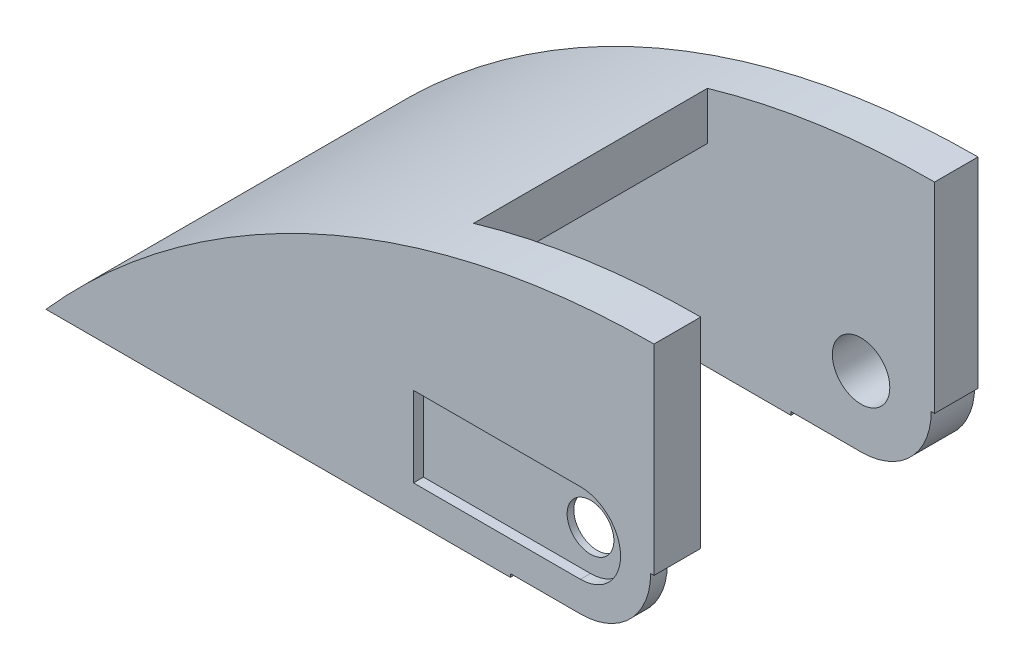
ISO-10303-21;
HEADER;
FILE_DESCRIPTION(('STEP AP214'),'2;1');
FILE_NAME('part.step','',(''),(''),'','','');
FILE_SCHEMA(('AUTOMOTIVE_DESIGN { 1 0 10303 214 1 1 1 1 }'));
ENDSEC;
DATA;
#1=APPLICATION_CONTEXT('core data for automotive mechanical design processes');
#2=APPLICATION_PROTOCOL_DEFINITION('international standard','automotive_design',2000,#1);
#3=PRODUCT_CONTEXT('',#1,'mechanical');
#4=PRODUCT('Part','Part','',(#3));
#5=PRODUCT_RELATED_PRODUCT_CATEGORY('part','',(#4));
#6=PRODUCT_DEFINITION_FORMATION('','',#4);
#7=PRODUCT_DEFINITION_CONTEXT('part definition',#1,'design');
#8=PRODUCT_DEFINITION('design','',#6,#7);
#9=PRODUCT_DEFINITION_SHAPE('','',#8);
#10=(LENGTH_UNIT() NAMED_UNIT(*) SI_UNIT(.MILLI.,.METRE.));
#11=(NAMED_UNIT(*) PLANE_ANGLE_UNIT() SI_UNIT($,.RADIAN.));
#12=(NAMED_UNIT(*) SI_UNIT($,.STERADIAN.) SOLID_ANGLE_UNIT());
#13=UNCERTAINTY_MEASURE_WITH_UNIT(LENGTH_MEASURE(1.E-05),#10,'distance_accuracy_value','');
#14=(GEOMETRIC_REPRESENTATION_CONTEXT(3) GLOBAL_UNCERTAINTY_ASSIGNED_CONTEXT((#13)) GLOBAL_UNIT_ASSIGNED_CONTEXT((#10,
#11,#12)) REPRESENTATION_CONTEXT('',''));
#15=CARTESIAN_POINT('',(0.,0.,0.));
#16=DIRECTION('',(0.,0.,1.));
#17=DIRECTION('',(1.,0.,0.));
#18=AXIS2_PLACEMENT_3D('',#15,#16,#17);
#19=CARTESIAN_POINT('',(0.,0.,0.));
#20=DIRECTION('',(0.,0.,1.));
#21=DIRECTION('',(1.,0.,0.));
#22=AXIS2_PLACEMENT_3D('',#19,#20,#21);
#23=PLANE('',#22);
#24=DIRECTION('',(-1.,0.,0.));
#25=VECTOR('',#24,1.);
#26=CARTESIAN_POINT('',(0.,0.,0.));
#27=LINE('',#26,#25);
#28=CARTESIAN_POINT('',(11.,0.,0.));
#29=VERTEX_POINT('',#28);
#30=CARTESIAN_POINT('',(10.5,0.,0.));
#31=VERTEX_POINT('',#30);
#32=EDGE_CURVE('E297',#29,#31,#27,.T.);
#33=ORIENTED_EDGE('',*,*,#32,.F.);
#34=DIRECTION('',(0.,-1.,0.));
#35=VECTOR('',#34,1.);
#36=CARTESIAN_POINT('',(11.,0.,0.));
#37=LINE('',#36,#35);
#38=CARTESIAN_POINT('',(11.,30.,0.));
#39=VERTEX_POINT('',#38);
#40=EDGE_CURVE('E416',#39,#29,#37,.T.);
#41=ORIENTED_EDGE('',*,*,#40,.F.);
#42=CARTESIAN_POINT('',(11.,-91.4878048780488,0.));
#43=DIRECTION('',(0.,0.,1.));
#44=DIRECTION('',(1.,0.,0.));
#45=AXIS2_PLACEMENT_3D('',#42,#43,#44);
#46=CIRCLE('',#45,121.487804878049);
#47=CARTESIAN_POINT('',(-80.,-11.,0.));
#48=VERTEX_POINT('',#47);
#49=EDGE_CURVE('E400',#48,#39,#46,.F.);
#50=ORIENTED_EDGE('',*,*,#49,.F.);
#51=DIRECTION('',(-1.,0.,0.));
#52=VECTOR('',#51,1.);
#53=CARTESIAN_POINT('',(0.,-11.,0.));
#54=LINE('',#53,#52);
#55=CARTESIAN_POINT('',(-10.5,-11.,0.));
#56=VERTEX_POINT('',#55);
#57=EDGE_CURVE('E405',#56,#48,#54,.T.);
#58=ORIENTED_EDGE('',*,*,#57,.F.);
#59=DIRECTION('',(0.,-1.,0.));
#60=VECTOR('',#59,1.);
#61=CARTESIAN_POINT('',(-10.5,0.,0.));
#62=LINE('',#61,#60);
#63=CARTESIAN_POINT('',(-10.5,-10.5,0.));
#64=VERTEX_POINT('',#63);
#65=EDGE_CURVE('E318',#64,#56,#62,.T.);
#66=ORIENTED_EDGE('',*,*,#65,.F.);
#67=DIRECTION('',(-1.,0.,0.));
#68=VECTOR('',#67,1.);
#69=CARTESIAN_POINT('',(0.,-10.5,0.));
#70=LINE('',#69,#68);
#71=CARTESIAN_POINT('',(0.,-10.5,0.));
#72=VERTEX_POINT('',#71);
#73=EDGE_CURVE('E314',#72,#64,#70,.T.);
#74=ORIENTED_EDGE('',*,*,#73,.F.);
#75=CARTESIAN_POINT('',(0.,0.,0.));
#76=DIRECTION('',(0.,0.,1.));
#77=DIRECTION('',(1.,0.,0.));
#78=AXIS2_PLACEMENT_3D('',#75,#76,#77);
#79=CIRCLE('',#78,10.5);
#80=EDGE_CURVE('E310',#72,#31,#79,.T.);
#81=ORIENTED_EDGE('',*,*,#80,.T.);
#82=EDGE_LOOP('',(#33,#41,#50,#58,#66,#74,#81));
#83=FACE_BOUND('',#82,.T.);
#84=CARTESIAN_POINT('',(0.,0.,0.));
#85=DIRECTION('',(0.,0.,1.));
#86=DIRECTION('',(1.,0.,0.));
#87=AXIS2_PLACEMENT_3D('',#84,#85,#86);
#88=CIRCLE('',#87,6.);
#89=CARTESIAN_POINT('',(0.,-6.,0.));
#90=VERTEX_POINT('',#89);
#91=CARTESIAN_POINT('',(0.,6.,0.));
#92=VERTEX_POINT('',#91);
#93=EDGE_CURVE('E244',#90,#92,#88,.T.);
#94=ORIENTED_EDGE('',*,*,#93,.F.);
#95=DIRECTION('',(-1.,0.,0.));
#96=VECTOR('',#95,1.);
#97=CARTESIAN_POINT('',(0.,-6.,0.));
#98=LINE('',#97,#96);
#99=CARTESIAN_POINT('',(-25.,-6.,0.));
#100=VERTEX_POINT('',#99);
#101=EDGE_CURVE('E65',#90,#100,#98,.T.);
#102=ORIENTED_EDGE('',*,*,#101,.T.);
#103=DIRECTION('',(0.,-1.,0.));
#104=VECTOR('',#103,1.);
#105=CARTESIAN_POINT('',(-25.,0.,0.));
#106=LINE('',#105,#104);
#107=CARTESIAN_POINT('',(-25.,6.,0.));
#108=VERTEX_POINT('',#107);
#109=EDGE_CURVE('E251',#108,#100,#106,.T.);
#110=ORIENTED_EDGE('',*,*,#109,.F.);
#111=DIRECTION('',(-1.,0.,0.));
#112=VECTOR('',#111,1.);
#113=CARTESIAN_POINT('',(0.,6.,0.));
#114=LINE('',#113,#112);
#115=EDGE_CURVE('E247',#92,#108,#114,.T.);
#116=ORIENTED_EDGE('',*,*,#115,.F.);
#117=EDGE_LOOP('',(#94,#102,#110,#116));
#118=FACE_BOUND('',#117,.T.);
#119=ADVANCED_FACE('F47',(#83,#118),#23,.T.);
#120=CARTESIAN_POINT('',(0.,0.,-21.7));
#121=DIRECTION('',(0.,0.,1.));
#122=DIRECTION('',(1.,0.,0.));
#123=AXIS2_PLACEMENT_3D('',#120,#121,#122);
#124=CYLINDRICAL_SURFACE('',#123,3.5);
#125=CARTESIAN_POINT('',(0.,0.,-2.5));
#126=DIRECTION('',(0.,0.,-1.));
#127=DIRECTION('',(0.,1.,0.));
#128=AXIS2_PLACEMENT_3D('',#125,#126,#127);
#129=CIRCLE('',#128,3.5);
#130=CARTESIAN_POINT('',(0.,3.5,-2.5));
#131=VERTEX_POINT('',#130);
#132=EDGE_CURVE('E51',#131,#131,#129,.T.);
#133=ORIENTED_EDGE('',*,*,#132,.T.);
#134=EDGE_LOOP('',(#133));
#135=FACE_BOUND('',#134,.T.);
#136=CARTESIAN_POINT('',(0.,0.,-1.5));
#137=DIRECTION('',(0.,0.,1.));
#138=DIRECTION('',(1.,0.,0.));
#139=AXIS2_PLACEMENT_3D('',#136,#137,#138);
#140=CIRCLE('',#139,3.5);
#141=CARTESIAN_POINT('',(3.5,0.,-1.5));
#142=VERTEX_POINT('',#141);
#143=EDGE_CURVE('E229',#142,#142,#140,.F.);
#144=ORIENTED_EDGE('',*,*,#143,.F.);
#145=EDGE_LOOP('',(#144));
#146=FACE_BOUND('',#145,.T.);
#147=ADVANCED_FACE('F534',(#135,#146),#124,.F.);
#148=CARTESIAN_POINT('',(12.,-12.,-7.));
#149=DIRECTION('',(0.,0.,1.));
#150=DIRECTION('',(0.,-1.,0.));
#151=AXIS2_PLACEMENT_3D('',#148,#149,#150);
#152=PLANE('',#151);
#153=DIRECTION('',(-1.,0.,0.));
#154=VECTOR('',#153,1.);
#155=CARTESIAN_POINT('',(12.,0.,-7.));
#156=LINE('',#155,#154);
#157=CARTESIAN_POINT('',(11.,0.,-7.00000000000004));
#158=VERTEX_POINT('',#157);
#159=CARTESIAN_POINT('',(9.5,0.,-7.));
#160=VERTEX_POINT('',#159);
#161=EDGE_CURVE('E349',#158,#160,#156,.T.);
#162=ORIENTED_EDGE('',*,*,#161,.T.);
#163=CARTESIAN_POINT('',(0.,0.,-7.));
#164=DIRECTION('',(0.,0.,-1.));
#165=DIRECTION('',(0.,1.,0.));
#166=AXIS2_PLACEMENT_3D('',#163,#164,#165);
#167=CIRCLE('',#166,9.5);
#168=CARTESIAN_POINT('',(-9.5,0.,-7.));
#169=VERTEX_POINT('',#168);
#170=EDGE_CURVE('E441',#169,#160,#167,.T.);
#171=ORIENTED_EDGE('',*,*,#170,.F.);
#172=DIRECTION('',(0.,1.,0.));
#173=VECTOR('',#172,1.);
#174=CARTESIAN_POINT('',(-9.5,-12.,-7.));
#175=LINE('',#174,#173);
#176=CARTESIAN_POINT('',(-9.5,-10.5,-7.00000000000001));
#177=VERTEX_POINT('',#176);
#178=EDGE_CURVE('E285',#177,#169,#175,.T.);
#179=ORIENTED_EDGE('',*,*,#178,.F.);
#180=DIRECTION('',(-1.,0.,0.));
#181=VECTOR('',#180,1.);
#182=CARTESIAN_POINT('',(12.,-10.5,-7.));
#183=LINE('',#182,#181);
#184=CARTESIAN_POINT('',(-10.5,-10.5,-7.00000000000001));
#185=VERTEX_POINT('',#184);
#186=EDGE_CURVE('E328',#177,#185,#183,.T.);
#187=ORIENTED_EDGE('',*,*,#186,.T.);
#188=DIRECTION('',(0.,-1.,0.));
#189=VECTOR('',#188,1.);
#190=CARTESIAN_POINT('',(-10.5,-12.,-7.));
#191=LINE('',#190,#189);
#192=CARTESIAN_POINT('',(-10.5,-11.,-7.00000000000001));
#193=VERTEX_POINT('',#192);
#194=EDGE_CURVE('E345',#185,#193,#191,.T.);
#195=ORIENTED_EDGE('',*,*,#194,.T.);
#196=DIRECTION('',(-1.,0.,0.));
#197=VECTOR('',#196,1.);
#198=CARTESIAN_POINT('',(0.,-11.,-7.));
#199=LINE('',#198,#197);
#200=CARTESIAN_POINT('',(-75.954431576152,-11.,-6.99999999999999));
#201=VERTEX_POINT('',#200);
#202=EDGE_CURVE('E401',#193,#201,#199,.T.);
#203=ORIENTED_EDGE('',*,*,#202,.T.);
#204=CARTESIAN_POINT('',(11.,-91.4878048780488,-6.99999999999999));
#205=DIRECTION('',(0.,0.,1.));
#206=DIRECTION('',(0.,-1.,0.));
#207=AXIS2_PLACEMENT_3D('',#204,#205,#206);
#208=CIRCLE('',#207,118.487804878049);
#209=CARTESIAN_POINT('',(-34.2965836217796,18.,-6.99999999999999));
#210=VERTEX_POINT('',#209);
#211=EDGE_CURVE('E382',#210,#201,#208,.T.);
#212=ORIENTED_EDGE('',*,*,#211,.F.);
#213=DIRECTION('',(1.,0.,0.));
#214=VECTOR('',#213,1.);
#215=CARTESIAN_POINT('',(0.,18.,-7.));
#216=LINE('',#215,#214);
#217=CARTESIAN_POINT('',(-23.,18.,-7.));
#218=VERTEX_POINT('',#217);
#219=EDGE_CURVE('E404',#210,#218,#216,.T.);
#220=ORIENTED_EDGE('',*,*,#219,.T.);
#221=DIRECTION('',(0.,1.,0.));
#222=VECTOR('',#221,1.);
#223=CARTESIAN_POINT('',(-23.,15.5,-6.99999999999999));
#224=LINE('',#223,#222);
#225=CARTESIAN_POINT('',(-23.,25.1453239237065,-6.99999999999999));
#226=VERTEX_POINT('',#225);
#227=EDGE_CURVE('E437',#218,#226,#224,.T.);
#228=ORIENTED_EDGE('',*,*,#227,.T.);
#229=CARTESIAN_POINT('',(11.0000000000003,-91.4878048780494,-6.99999999999999));
#230=DIRECTION('',(0.,0.,1.));
#231=DIRECTION('',(0.,-1.,0.));
#232=AXIS2_PLACEMENT_3D('',#229,#230,#231);
#233=CIRCLE('',#232,121.487804878049);
#234=CARTESIAN_POINT('',(11.,30.,-7.00000000000003));
#235=VERTEX_POINT('',#234);
#236=EDGE_CURVE('E390',#226,#235,#233,.F.);
#237=ORIENTED_EDGE('',*,*,#236,.T.);
#238=DIRECTION('',(0.,-1.,0.));
#239=VECTOR('',#238,1.);
#240=CARTESIAN_POINT('',(11.,-12.,-7.));
#241=LINE('',#240,#239);
#242=EDGE_CURVE('E429',#235,#158,#241,.T.);
#243=ORIENTED_EDGE('',*,*,#242,.T.);
#244=EDGE_LOOP('',(#162,#171,#179,#187,#195,#203,#212,#220,#228,#237,#243));
#245=FACE_BOUND('',#244,.T.);
#246=ADVANCED_FACE('F541',(#245),#152,.F.);
#247=CARTESIAN_POINT('',(0.,0.,-2.5));
#248=DIRECTION('',(0.,0.,-1.));
#249=DIRECTION('',(0.,1.,0.));
#250=AXIS2_PLACEMENT_3D('',#247,#248,#249);
#251=CYLINDRICAL_SURFACE('',#250,9.5);
#252=DIRECTION('',(0.,0.,-1.));
#253=VECTOR('',#252,1.);
#254=CARTESIAN_POINT('',(9.5,0.,-2.5));
#255=LINE('',#254,#253);
#256=CARTESIAN_POINT('',(9.5,0.,-2.5));
#257=VERTEX_POINT('',#256);
#258=EDGE_CURVE('E281',#257,#160,#255,.T.);
#259=ORIENTED_EDGE('',*,*,#258,.F.);
#260=CARTESIAN_POINT('',(0.,0.,-2.5));
#261=DIRECTION('',(0.,0.,-1.));
#262=DIRECTION('',(0.,1.,0.));
#263=AXIS2_PLACEMENT_3D('',#260,#261,#262);
#264=CIRCLE('',#263,9.5);
#265=CARTESIAN_POINT('',(-9.5,0.,-2.5));
#266=VERTEX_POINT('',#265);
#267=EDGE_CURVE('E440',#266,#257,#264,.T.);
#268=ORIENTED_EDGE('',*,*,#267,.F.);
#269=DIRECTION('',(0.,0.,-1.));
#270=VECTOR('',#269,1.);
#271=CARTESIAN_POINT('',(-9.5,0.,-2.5));
#272=LINE('',#271,#270);
#273=EDGE_CURVE('E277',#266,#169,#272,.T.);
#274=ORIENTED_EDGE('',*,*,#273,.T.);
#275=ORIENTED_EDGE('',*,*,#170,.T.);
#276=EDGE_LOOP('',(#259,#268,#274,#275));
#277=FACE_BOUND('',#276,.T.);
#278=ADVANCED_FACE('F551',(#277),#251,.F.);
#279=CARTESIAN_POINT('',(0.,-10.5,-48.5));
#280=DIRECTION('',(0.,1.,0.));
#281=DIRECTION('',(0.,0.,1.));
#282=AXIS2_PLACEMENT_3D('',#279,#280,#281);
#283=PLANE('',#282);
#284=DIRECTION('',(0.,0.,-1.));
#285=VECTOR('',#284,1.);
#286=CARTESIAN_POINT('',(-9.5,-10.5,-2.5));
#287=LINE('',#286,#285);
#288=CARTESIAN_POINT('',(-9.5,-10.5,-2.5));
#289=VERTEX_POINT('',#288);
#290=EDGE_CURVE('E274',#289,#177,#287,.T.);
#291=ORIENTED_EDGE('',*,*,#290,.F.);
#292=DIRECTION('',(-1.,0.,0.));
#293=VECTOR('',#292,1.);
#294=CARTESIAN_POINT('',(0.,-10.5,-2.5));
#295=LINE('',#294,#293);
#296=CARTESIAN_POINT('',(0.,-10.5,-2.50000000000002));
#297=VERTEX_POINT('',#296);
#298=EDGE_CURVE('E263',#297,#289,#295,.T.);
#299=ORIENTED_EDGE('',*,*,#298,.F.);
#300=DIRECTION('',(0.,0.,1.));
#301=VECTOR('',#300,1.);
#302=CARTESIAN_POINT('',(0.,-10.5,-48.5));
#303=LINE('',#302,#301);
#304=EDGE_CURVE('E309',#297,#72,#303,.T.);
#305=ORIENTED_EDGE('',*,*,#304,.T.);
#306=ORIENTED_EDGE('',*,*,#73,.T.);
#307=DIRECTION('',(0.,0.,1.));
#308=VECTOR('',#307,1.);
#309=CARTESIAN_POINT('',(-10.5,-10.5,-48.5));
#310=LINE('',#309,#308);
#311=EDGE_CURVE('E339',#185,#64,#310,.T.);
#312=ORIENTED_EDGE('',*,*,#311,.F.);
#313=ORIENTED_EDGE('',*,*,#186,.F.);
#314=EDGE_LOOP('',(#291,#299,#305,#306,#312,#313));
#315=FACE_BOUND('',#314,.T.);
#316=ADVANCED_FACE('F526',(#315),#283,.F.);
#317=CARTESIAN_POINT('',(11.,0.,-48.5));
#318=DIRECTION('',(-1.,0.,0.));
#319=DIRECTION('',(0.,0.,1.));
#320=AXIS2_PLACEMENT_3D('',#317,#318,#319);
#321=PLANE('',#320);
#322=DIRECTION('',(0.,1.,0.));
#323=VECTOR('',#322,1.);
#324=CARTESIAN_POINT('',(11.,0.,-42.));
#325=LINE('',#324,#323);
#326=CARTESIAN_POINT('',(11.,0.,-42.));
#327=VERTEX_POINT('',#326);
#328=CARTESIAN_POINT('',(11.,30.,-42.));
#329=VERTEX_POINT('',#328);
#330=EDGE_CURVE('E352',#327,#329,#325,.T.);
#331=ORIENTED_EDGE('',*,*,#330,.F.);
#332=DIRECTION('',(0.,0.,1.));
#333=VECTOR('',#332,1.);
#334=CARTESIAN_POINT('',(11.,0.,-48.5));
#335=LINE('',#334,#333);
#336=CARTESIAN_POINT('',(11.,0.,-48.5));
#337=VERTEX_POINT('',#336);
#338=EDGE_CURVE('E431',#337,#327,#335,.T.);
#339=ORIENTED_EDGE('',*,*,#338,.F.);
#340=DIRECTION('',(0.,-1.,0.));
#341=VECTOR('',#340,1.);
#342=CARTESIAN_POINT('',(11.,0.,-48.5));
#343=LINE('',#342,#341);
#344=CARTESIAN_POINT('',(11.,30.,-48.5));
#345=VERTEX_POINT('',#344);
#346=EDGE_CURVE('E417',#345,#337,#343,.T.);
#347=ORIENTED_EDGE('',*,*,#346,.F.);
#348=DIRECTION('',(0.,0.,1.));
#349=VECTOR('',#348,1.);
#350=CARTESIAN_POINT('',(11.,30.,-48.5));
#351=LINE('',#350,#349);
#352=EDGE_CURVE('E425',#345,#329,#351,.T.);
#353=ORIENTED_EDGE('',*,*,#352,.T.);
#354=EDGE_LOOP('',(#331,#339,#347,#353));
#355=FACE_BOUND('',#354,.T.);
#356=ADVANCED_FACE('F482',(#355),#321,.F.);
#357=CARTESIAN_POINT('',(12.,18.,-7.));
#358=DIRECTION('',(0.,1.,0.));
#359=DIRECTION('',(0.,0.,1.));
#360=AXIS2_PLACEMENT_3D('',#357,#358,#359);
#361=PLANE('',#360);
#362=DIRECTION('',(0.,0.,1.));
#363=VECTOR('',#362,1.);
#364=CARTESIAN_POINT('',(-34.2965836217796,18.,-41.5));
#365=LINE('',#364,#363);
#366=CARTESIAN_POINT('',(-34.2965836217796,18.,-42.));
#367=VERTEX_POINT('',#366);
#368=EDGE_CURVE('E379',#367,#210,#365,.T.);
#369=ORIENTED_EDGE('',*,*,#368,.F.);
#370=DIRECTION('',(-1.,0.,0.));
#371=VECTOR('',#370,1.);
#372=CARTESIAN_POINT('',(0.,18.,-42.));
#373=LINE('',#372,#371);
#374=CARTESIAN_POINT('',(-23.,18.,-42.));
#375=VERTEX_POINT('',#374);
#376=EDGE_CURVE('E363',#375,#367,#373,.T.);
#377=ORIENTED_EDGE('',*,*,#376,.F.);
#378=DIRECTION('',(0.,0.,1.));
#379=VECTOR('',#378,1.);
#380=CARTESIAN_POINT('',(-23.,18.,-6.99999999999999));
#381=LINE('',#380,#379);
#382=EDGE_CURVE('E445',#375,#218,#381,.T.);
#383=ORIENTED_EDGE('',*,*,#382,.T.);
#384=ORIENTED_EDGE('',*,*,#219,.F.);
#385=EDGE_LOOP('',(#369,#377,#383,#384));
#386=FACE_BOUND('',#385,.T.);
#387=ADVANCED_FACE('F496',(#386),#361,.F.);
#388=CARTESIAN_POINT('',(0.,0.,-48.5));
#389=DIRECTION('',(0.,0.,-1.));
#390=DIRECTION('',(-1.,0.,0.));
#391=AXIS2_PLACEMENT_3D('',#388,#389,#390);
#392=PLANE('',#391);
#393=CARTESIAN_POINT('',(0.,0.,-48.5));
#394=DIRECTION('',(0.,0.,1.));
#395=DIRECTION('',(1.,0.,0.));
#396=AXIS2_PLACEMENT_3D('',#393,#394,#395);
#397=CIRCLE('',#396,4.3);
#398=CARTESIAN_POINT('',(4.3,0.,-48.5));
#399=VERTEX_POINT('',#398);
#400=EDGE_CURVE('E288',#399,#399,#397,.T.);
#401=ORIENTED_EDGE('',*,*,#400,.T.);
#402=EDGE_LOOP('',(#401));
#403=FACE_BOUND('',#402,.T.);
#404=DIRECTION('',(-1.,0.,0.));
#405=VECTOR('',#404,1.);
#406=CARTESIAN_POINT('',(0.,0.,-48.5));
#407=LINE('',#406,#405);
#408=CARTESIAN_POINT('',(10.5,0.,-48.5));
#409=VERTEX_POINT('',#408);
#410=EDGE_CURVE('E305',#337,#409,#407,.T.);
#411=ORIENTED_EDGE('',*,*,#410,.T.);
#412=CARTESIAN_POINT('',(0.,0.,-48.5));
#413=DIRECTION('',(0.,0.,1.));
#414=DIRECTION('',(1.,0.,0.));
#415=AXIS2_PLACEMENT_3D('',#412,#413,#414);
#416=CIRCLE('',#415,10.5);
#417=CARTESIAN_POINT('',(0.,-10.5,-48.5));
#418=VERTEX_POINT('',#417);
#419=EDGE_CURVE('E293',#418,#409,#416,.T.);
#420=ORIENTED_EDGE('',*,*,#419,.F.);
#421=DIRECTION('',(-1.,0.,0.));
#422=VECTOR('',#421,1.);
#423=CARTESIAN_POINT('',(0.,-10.5,-48.5));
#424=LINE('',#423,#422);
#425=CARTESIAN_POINT('',(-10.5,-10.5,-48.5));
#426=VERTEX_POINT('',#425);
#427=EDGE_CURVE('E296',#418,#426,#424,.T.);
#428=ORIENTED_EDGE('',*,*,#427,.T.);
#429=DIRECTION('',(0.,-1.,0.));
#430=VECTOR('',#429,1.);
#431=CARTESIAN_POINT('',(-10.5,0.,-48.5));
#432=LINE('',#431,#430);
#433=CARTESIAN_POINT('',(-10.5,-11.,-48.5));
#434=VERTEX_POINT('',#433);
#435=EDGE_CURVE('E301',#426,#434,#432,.T.);
#436=ORIENTED_EDGE('',*,*,#435,.T.);
#437=DIRECTION('',(-1.,0.,0.));
#438=VECTOR('',#437,1.);
#439=CARTESIAN_POINT('',(0.,-11.,-48.5));
#440=LINE('',#439,#438);
#441=CARTESIAN_POINT('',(-80.,-11.,-48.5));
#442=VERTEX_POINT('',#441);
#443=EDGE_CURVE('E397',#434,#442,#440,.T.);
#444=ORIENTED_EDGE('',*,*,#443,.T.);
#445=CARTESIAN_POINT('',(11.,-91.4878048780488,-48.5));
#446=DIRECTION('',(0.,0.,1.));
#447=DIRECTION('',(1.,0.,0.));
#448=AXIS2_PLACEMENT_3D('',#445,#446,#447);
#449=CIRCLE('',#448,121.487804878049);
#450=EDGE_CURVE('E394',#442,#345,#449,.F.);
#451=ORIENTED_EDGE('',*,*,#450,.T.);
#452=ORIENTED_EDGE('',*,*,#346,.T.);
#453=EDGE_LOOP('',(#411,#420,#428,#436,#444,#451,#452));
#454=FACE_BOUND('',#453,.T.);
#455=ADVANCED_FACE('F511',(#403,#454),#392,.T.);
#456=CARTESIAN_POINT('',(0.,0.,-2.5));
#457=DIRECTION('',(0.,0.,-1.));
#458=DIRECTION('',(0.,1.,0.));
#459=AXIS2_PLACEMENT_3D('',#456,#457,#458);
#460=PLANE('',#459);
#461=ORIENTED_EDGE('',*,*,#132,.F.);
#462=EDGE_LOOP('',(#461));
#463=FACE_BOUND('',#462,.T.);
#464=ORIENTED_EDGE('',*,*,#267,.T.);
#465=DIRECTION('',(-1.,0.,0.));
#466=VECTOR('',#465,1.);
#467=CARTESIAN_POINT('',(0.,0.,-2.5));
#468=LINE('',#467,#466);
#469=CARTESIAN_POINT('',(10.5,0.,-2.5));
#470=VERTEX_POINT('',#469);
#471=EDGE_CURVE('E268',#470,#257,#468,.T.);
#472=ORIENTED_EDGE('',*,*,#471,.F.);
#473=CARTESIAN_POINT('',(0.,0.,-2.5));
#474=DIRECTION('',(0.,0.,1.));
#475=DIRECTION('',(1.,0.,0.));
#476=AXIS2_PLACEMENT_3D('',#473,#474,#475);
#477=CIRCLE('',#476,10.5);
#478=EDGE_CURVE('E73',#297,#470,#477,.T.);
#479=ORIENTED_EDGE('',*,*,#478,.F.);
#480=ORIENTED_EDGE('',*,*,#298,.T.);
#481=DIRECTION('',(0.,-1.,0.));
#482=VECTOR('',#481,1.);
#483=CARTESIAN_POINT('',(-9.5,0.,-2.5));
#484=LINE('',#483,#482);
#485=EDGE_CURVE('E271',#266,#289,#484,.T.);
#486=ORIENTED_EDGE('',*,*,#485,.F.);
#487=EDGE_LOOP('',(#464,#472,#479,#480,#486));
#488=FACE_BOUND('',#487,.T.);
#489=ADVANCED_FACE('F49',(#463,#488),#460,.T.);
#490=CARTESIAN_POINT('',(-23.,15.5,-41.));
#491=DIRECTION('',(-1.,0.,0.));
#492=DIRECTION('',(0.,0.,1.));
#493=AXIS2_PLACEMENT_3D('',#490,#491,#492);
#494=PLANE('',#493);
#495=DIRECTION('',(0.,0.,1.));
#496=VECTOR('',#495,1.);
#497=CARTESIAN_POINT('',(-23.,25.1453239237065,-48.5));
#498=LINE('',#497,#496);
#499=CARTESIAN_POINT('',(-23.,25.1453239237065,-42.));
#500=VERTEX_POINT('',#499);
#501=EDGE_CURVE('E386',#500,#226,#498,.T.);
#502=ORIENTED_EDGE('',*,*,#501,.T.);
#503=ORIENTED_EDGE('',*,*,#227,.F.);
#504=ORIENTED_EDGE('',*,*,#382,.F.);
#505=DIRECTION('',(0.,-1.,0.));
#506=VECTOR('',#505,1.);
#507=CARTESIAN_POINT('',(-23.,0.,-42.));
#508=LINE('',#507,#506);
#509=EDGE_CURVE('E359',#500,#375,#508,.T.);
#510=ORIENTED_EDGE('',*,*,#509,.F.);
#511=EDGE_LOOP('',(#502,#503,#504,#510));
#512=FACE_BOUND('',#511,.T.);
#513=ADVANCED_FACE('F492',(#512),#494,.F.);
#514=EDGE_CURVE('E430',#235,#39,#351,.T.);
#515=ORIENTED_EDGE('',*,*,#514,.T.);
#516=ORIENTED_EDGE('',*,*,#40,.T.);
#517=EDGE_CURVE('E421',#158,#29,#335,.T.);
#518=ORIENTED_EDGE('',*,*,#517,.F.);
#519=ORIENTED_EDGE('',*,*,#242,.F.);
#520=EDGE_LOOP('',(#515,#516,#518,#519));
#521=FACE_BOUND('',#520,.T.);
#522=ADVANCED_FACE('F573',(#521),#321,.F.);
#523=CARTESIAN_POINT('',(11.,-91.4878048780488,-7.));
#524=DIRECTION('',(0.,0.,1.));
#525=DIRECTION('',(1.,0.,0.));
#526=AXIS2_PLACEMENT_3D('',#523,#524,#525);
#527=CYLINDRICAL_SURFACE('',#526,121.487804878049);
#528=ORIENTED_EDGE('',*,*,#501,.F.);
#529=CARTESIAN_POINT('',(11.0000000000003,-91.4878048780494,-42.));
#530=DIRECTION('',(0.,0.,1.));
#531=DIRECTION('',(1.,0.,0.));
#532=AXIS2_PLACEMENT_3D('',#529,#530,#531);
#533=CIRCLE('',#532,121.487804878049);
#534=EDGE_CURVE('E355',#329,#500,#533,.T.);
#535=ORIENTED_EDGE('',*,*,#534,.F.);
#536=ORIENTED_EDGE('',*,*,#352,.F.);
#537=ORIENTED_EDGE('',*,*,#450,.F.);
#538=DIRECTION('',(0.,0.,1.));
#539=VECTOR('',#538,1.);
#540=CARTESIAN_POINT('',(-80.,-11.,-7.));
#541=LINE('',#540,#539);
#542=EDGE_CURVE('E408',#442,#48,#541,.T.);
#543=ORIENTED_EDGE('',*,*,#542,.T.);
#544=ORIENTED_EDGE('',*,*,#49,.T.);
#545=ORIENTED_EDGE('',*,*,#514,.F.);
#546=ORIENTED_EDGE('',*,*,#236,.F.);
#547=EDGE_LOOP('',(#528,#535,#536,#537,#543,#544,#545,#546));
#548=FACE_BOUND('',#547,.T.);
#549=ADVANCED_FACE('F487',(#548),#527,.T.);
#550=CARTESIAN_POINT('',(0.,-11.,-7.));
#551=DIRECTION('',(0.,1.,0.));
#552=DIRECTION('',(-1.,0.,0.));
#553=AXIS2_PLACEMENT_3D('',#550,#551,#552);
#554=PLANE('',#553);
#555=ORIENTED_EDGE('',*,*,#443,.F.);
#556=DIRECTION('',(0.,0.,1.));
#557=VECTOR('',#556,1.);
#558=CARTESIAN_POINT('',(-10.5,-11.,-48.5));
#559=LINE('',#558,#557);
#560=CARTESIAN_POINT('',(-10.5,-11.,-42.));
#561=VERTEX_POINT('',#560);
#562=EDGE_CURVE('E330',#434,#561,#559,.T.);
#563=ORIENTED_EDGE('',*,*,#562,.T.);
#564=DIRECTION('',(1.,0.,0.));
#565=VECTOR('',#564,1.);
#566=CARTESIAN_POINT('',(0.,-11.,-42.));
#567=LINE('',#566,#565);
#568=CARTESIAN_POINT('',(-75.954431576152,-11.,-42.));
#569=VERTEX_POINT('',#568);
#570=EDGE_CURVE('E371',#569,#561,#567,.T.);
#571=ORIENTED_EDGE('',*,*,#570,.F.);
#572=DIRECTION('',(0.,0.,1.));
#573=VECTOR('',#572,1.);
#574=CARTESIAN_POINT('',(-75.954431576152,-11.,-41.5));
#575=LINE('',#574,#573);
#576=EDGE_CURVE('E375',#569,#201,#575,.T.);
#577=ORIENTED_EDGE('',*,*,#576,.T.);
#578=ORIENTED_EDGE('',*,*,#202,.F.);
#579=EDGE_CURVE('E334',#193,#56,#559,.T.);
#580=ORIENTED_EDGE('',*,*,#579,.T.);
#581=ORIENTED_EDGE('',*,*,#57,.T.);
#582=ORIENTED_EDGE('',*,*,#542,.F.);
#583=EDGE_LOOP('',(#555,#563,#571,#577,#578,#580,#581,#582));
#584=FACE_BOUND('',#583,.T.);
#585=ADVANCED_FACE('F504',(#584),#554,.F.);
#586=CARTESIAN_POINT('',(11.,-91.4878048780488,-41.5));
#587=DIRECTION('',(0.,0.,1.));
#588=DIRECTION('',(1.,0.,0.));
#589=AXIS2_PLACEMENT_3D('',#586,#587,#588);
#590=CYLINDRICAL_SURFACE('',#589,118.487804878049);
#591=ORIENTED_EDGE('',*,*,#368,.T.);
#592=ORIENTED_EDGE('',*,*,#211,.T.);
#593=ORIENTED_EDGE('',*,*,#576,.F.);
#594=CARTESIAN_POINT('',(11.,-91.4878048780488,-42.));
#595=DIRECTION('',(0.,0.,1.));
#596=DIRECTION('',(1.,0.,0.));
#597=AXIS2_PLACEMENT_3D('',#594,#595,#596);
#598=CIRCLE('',#597,118.487804878049);
#599=EDGE_CURVE('E367',#367,#569,#598,.T.);
#600=ORIENTED_EDGE('',*,*,#599,.F.);
#601=EDGE_LOOP('',(#591,#592,#593,#600));
#602=FACE_BOUND('',#601,.T.);
#603=ADVANCED_FACE('F471',(#602),#590,.F.);
#604=CARTESIAN_POINT('',(0.,0.,-42.));
#605=DIRECTION('',(0.,0.,1.));
#606=DIRECTION('',(1.,0.,0.));
#607=AXIS2_PLACEMENT_3D('',#604,#605,#606);
#608=PLANE('',#607);
#609=CARTESIAN_POINT('',(0.,0.,-42.));
#610=DIRECTION('',(0.,0.,1.));
#611=DIRECTION('',(1.,0.,0.));
#612=AXIS2_PLACEMENT_3D('',#609,#610,#611);
#613=CIRCLE('',#612,4.3);
#614=CARTESIAN_POINT('',(4.3,0.,-42.));
#615=VERTEX_POINT('',#614);
#616=EDGE_CURVE('E292',#615,#615,#613,.T.);
#617=ORIENTED_EDGE('',*,*,#616,.F.);
#618=EDGE_LOOP('',(#617));
#619=FACE_BOUND('',#618,.T.);
#620=DIRECTION('',(-1.,0.,0.));
#621=VECTOR('',#620,1.);
#622=CARTESIAN_POINT('',(0.,0.,-42.));
#623=LINE('',#622,#621);
#624=CARTESIAN_POINT('',(10.5,0.,-42.));
#625=VERTEX_POINT('',#624);
#626=EDGE_CURVE('E11',#327,#625,#623,.T.);
#627=ORIENTED_EDGE('',*,*,#626,.F.);
#628=ORIENTED_EDGE('',*,*,#330,.T.);
#629=ORIENTED_EDGE('',*,*,#534,.T.);
#630=ORIENTED_EDGE('',*,*,#509,.T.);
#631=ORIENTED_EDGE('',*,*,#376,.T.);
#632=ORIENTED_EDGE('',*,*,#599,.T.);
#633=ORIENTED_EDGE('',*,*,#570,.T.);
#634=DIRECTION('',(0.,-1.,0.));
#635=VECTOR('',#634,1.);
#636=CARTESIAN_POINT('',(-10.5,0.,-42.));
#637=LINE('',#636,#635);
#638=CARTESIAN_POINT('',(-10.5,-10.5,-42.));
#639=VERTEX_POINT('',#638);
#640=EDGE_CURVE('E455',#639,#561,#637,.T.);
#641=ORIENTED_EDGE('',*,*,#640,.F.);
#642=DIRECTION('',(-1.,0.,0.));
#643=VECTOR('',#642,1.);
#644=CARTESIAN_POINT('',(0.,-10.5,-42.));
#645=LINE('',#644,#643);
#646=CARTESIAN_POINT('',(0.,-10.5,-42.));
#647=VERTEX_POINT('',#646);
#648=EDGE_CURVE('E452',#647,#639,#645,.T.);
#649=ORIENTED_EDGE('',*,*,#648,.F.);
#650=CARTESIAN_POINT('',(0.,0.,-42.));
#651=DIRECTION('',(0.,0.,1.));
#652=DIRECTION('',(1.,0.,0.));
#653=AXIS2_PLACEMENT_3D('',#650,#651,#652);
#654=CIRCLE('',#653,10.5);
#655=EDGE_CURVE('E57',#647,#625,#654,.T.);
#656=ORIENTED_EDGE('',*,*,#655,.T.);
#657=EDGE_LOOP('',(#627,#628,#629,#630,#631,#632,#633,#641,#649,#656));
#658=FACE_BOUND('',#657,.T.);
#659=ADVANCED_FACE('F467',(#619,#658),#608,.T.);
#660=CARTESIAN_POINT('',(0.,0.,-48.5));
#661=DIRECTION('',(0.,1.,0.));
#662=DIRECTION('',(0.,0.,1.));
#663=AXIS2_PLACEMENT_3D('',#660,#661,#662);
#664=PLANE('',#663);
#665=ORIENTED_EDGE('',*,*,#626,.T.);
#666=DIRECTION('',(0.,0.,1.));
#667=VECTOR('',#666,1.);
#668=CARTESIAN_POINT('',(10.5,0.,-48.5));
#669=LINE('',#668,#667);
#670=EDGE_CURVE('E324',#409,#625,#669,.T.);
#671=ORIENTED_EDGE('',*,*,#670,.F.);
#672=ORIENTED_EDGE('',*,*,#410,.F.);
#673=ORIENTED_EDGE('',*,*,#338,.T.);
#674=EDGE_LOOP('',(#665,#671,#672,#673));
#675=FACE_BOUND('',#674,.T.);
#676=ADVANCED_FACE('F470',(#675),#664,.F.);
#677=ORIENTED_EDGE('',*,*,#648,.T.);
#678=EDGE_CURVE('E335',#426,#639,#310,.T.);
#679=ORIENTED_EDGE('',*,*,#678,.F.);
#680=ORIENTED_EDGE('',*,*,#427,.F.);
#681=EDGE_CURVE('E340',#418,#647,#303,.T.);
#682=ORIENTED_EDGE('',*,*,#681,.T.);
#683=EDGE_LOOP('',(#677,#679,#680,#682));
#684=FACE_BOUND('',#683,.T.);
#685=ADVANCED_FACE('F515',(#684),#283,.F.);
#686=CARTESIAN_POINT('',(-10.5,0.,-48.5));
#687=DIRECTION('',(-1.,0.,0.));
#688=DIRECTION('',(0.,0.,1.));
#689=AXIS2_PLACEMENT_3D('',#686,#687,#688);
#690=PLANE('',#689);
#691=ORIENTED_EDGE('',*,*,#640,.T.);
#692=ORIENTED_EDGE('',*,*,#562,.F.);
#693=ORIENTED_EDGE('',*,*,#435,.F.);
#694=ORIENTED_EDGE('',*,*,#678,.T.);
#695=EDGE_LOOP('',(#691,#692,#693,#694));
#696=FACE_BOUND('',#695,.T.);
#697=ADVANCED_FACE('F509',(#696),#690,.F.);
#698=CARTESIAN_POINT('',(0.,0.,-48.5));
#699=DIRECTION('',(0.,0.,1.));
#700=DIRECTION('',(1.,0.,0.));
#701=AXIS2_PLACEMENT_3D('',#698,#699,#700);
#702=CYLINDRICAL_SURFACE('',#701,10.5);
#703=ORIENTED_EDGE('',*,*,#681,.F.);
#704=ORIENTED_EDGE('',*,*,#419,.T.);
#705=ORIENTED_EDGE('',*,*,#670,.T.);
#706=ORIENTED_EDGE('',*,*,#655,.F.);
#707=EDGE_LOOP('',(#703,#704,#705,#706));
#708=FACE_BOUND('',#707,.T.);
#709=ADVANCED_FACE('F517',(#708),#702,.T.);
#710=ORIENTED_EDGE('',*,*,#478,.T.);
#711=EDGE_CURVE('E329',#470,#31,#669,.T.);
#712=ORIENTED_EDGE('',*,*,#711,.T.);
#713=ORIENTED_EDGE('',*,*,#80,.F.);
#714=ORIENTED_EDGE('',*,*,#304,.F.);
#715=EDGE_LOOP('',(#710,#712,#713,#714));
#716=FACE_BOUND('',#715,.T.);
#717=ADVANCED_FACE('F531',(#716),#702,.T.);
#718=ORIENTED_EDGE('',*,*,#517,.T.);
#719=ORIENTED_EDGE('',*,*,#32,.T.);
#720=ORIENTED_EDGE('',*,*,#711,.F.);
#721=ORIENTED_EDGE('',*,*,#471,.T.);
#722=ORIENTED_EDGE('',*,*,#258,.T.);
#723=ORIENTED_EDGE('',*,*,#161,.F.);
#724=EDGE_LOOP('',(#718,#719,#720,#721,#722,#723));
#725=FACE_BOUND('',#724,.T.);
#726=ADVANCED_FACE('F520',(#725),#664,.F.);
#727=ORIENTED_EDGE('',*,*,#311,.T.);
#728=ORIENTED_EDGE('',*,*,#65,.T.);
#729=ORIENTED_EDGE('',*,*,#579,.F.);
#730=ORIENTED_EDGE('',*,*,#194,.F.);
#731=EDGE_LOOP('',(#727,#728,#729,#730));
#732=FACE_BOUND('',#731,.T.);
#733=ADVANCED_FACE('F530',(#732),#690,.F.);
#734=CARTESIAN_POINT('',(0.,0.,-48.5));
#735=DIRECTION('',(0.,0.,1.));
#736=DIRECTION('',(1.,0.,0.));
#737=AXIS2_PLACEMENT_3D('',#734,#735,#736);
#738=CYLINDRICAL_SURFACE('',#737,4.3);
#739=CARTESIAN_POINT('',(4.3,0.,-42.));
#740=CARTESIAN_POINT('',(4.3,0.,-42.0677083333333));
#741=CARTESIAN_POINT('',(4.3,0.,-42.1354166666667));
#742=CARTESIAN_POINT('',(4.3,0.,-42.2708333333333));
#743=CARTESIAN_POINT('',(4.3,0.,-42.3385416666667));
#744=CARTESIAN_POINT('',(4.3,0.,-42.4739583333333));
#745=CARTESIAN_POINT('',(4.3,0.,-42.5416666666667));
#746=CARTESIAN_POINT('',(4.3,0.,-42.6770833333333));
#747=CARTESIAN_POINT('',(4.3,0.,-42.7447916666667));
#748=CARTESIAN_POINT('',(4.3,0.,-42.8802083333333));
#749=CARTESIAN_POINT('',(4.3,0.,-42.9479166666667));
#750=CARTESIAN_POINT('',(4.3,0.,-43.0833333333333));
#751=CARTESIAN_POINT('',(4.3,0.,-43.1510416666667));
#752=CARTESIAN_POINT('',(4.3,0.,-43.2864583333333));
#753=CARTESIAN_POINT('',(4.3,0.,-43.3541666666667));
#754=CARTESIAN_POINT('',(4.3,0.,-43.4895833333333));
#755=CARTESIAN_POINT('',(4.3,0.,-43.5572916666667));
#756=CARTESIAN_POINT('',(4.3,0.,-43.6927083333333));
#757=CARTESIAN_POINT('',(4.3,0.,-43.7604166666667));
#758=CARTESIAN_POINT('',(4.3,0.,-43.8958333333333));
#759=CARTESIAN_POINT('',(4.3,0.,-43.9635416666667));
#760=CARTESIAN_POINT('',(4.3,0.,-44.0989583333333));
#761=CARTESIAN_POINT('',(4.3,0.,-44.1666666666667));
#762=CARTESIAN_POINT('',(4.3,0.,-44.3020833333333));
#763=CARTESIAN_POINT('',(4.3,0.,-44.3697916666667));
#764=CARTESIAN_POINT('',(4.3,0.,-44.5052083333333));
#765=CARTESIAN_POINT('',(4.3,0.,-44.5729166666667));
#766=CARTESIAN_POINT('',(4.3,0.,-44.7083333333333));
#767=CARTESIAN_POINT('',(4.3,0.,-44.7760416666667));
#768=CARTESIAN_POINT('',(4.3,0.,-44.9114583333333));
#769=CARTESIAN_POINT('',(4.3,0.,-44.9791666666667));
#770=CARTESIAN_POINT('',(4.3,0.,-45.1145833333333));
#771=CARTESIAN_POINT('',(4.3,0.,-45.1822916666667));
#772=CARTESIAN_POINT('',(4.3,0.,-45.3177083333333));
#773=CARTESIAN_POINT('',(4.3,0.,-45.3854166666667));
#774=CARTESIAN_POINT('',(4.3,0.,-45.5208333333333));
#775=CARTESIAN_POINT('',(4.3,0.,-45.5885416666667));
#776=CARTESIAN_POINT('',(4.3,0.,-45.7239583333333));
#777=CARTESIAN_POINT('',(4.3,0.,-45.7916666666667));
#778=CARTESIAN_POINT('',(4.3,0.,-45.9270833333333));
#779=CARTESIAN_POINT('',(4.3,0.,-45.9947916666667));
#780=CARTESIAN_POINT('',(4.3,0.,-46.1302083333333));
#781=CARTESIAN_POINT('',(4.3,0.,-46.1979166666667));
#782=CARTESIAN_POINT('',(4.3,0.,-46.3333333333333));
#783=CARTESIAN_POINT('',(4.3,0.,-46.4010416666667));
#784=CARTESIAN_POINT('',(4.3,0.,-46.5364583333333));
#785=CARTESIAN_POINT('',(4.3,0.,-46.6041666666667));
#786=CARTESIAN_POINT('',(4.3,0.,-46.7395833333333));
#787=CARTESIAN_POINT('',(4.3,0.,-46.8072916666667));
#788=CARTESIAN_POINT('',(4.3,0.,-46.9427083333333));
#789=CARTESIAN_POINT('',(4.3,0.,-47.0104166666667));
#790=CARTESIAN_POINT('',(4.3,0.,-47.1458333333333));
#791=CARTESIAN_POINT('',(4.3,0.,-47.2135416666667));
#792=CARTESIAN_POINT('',(4.3,0.,-47.3489583333333));
#793=CARTESIAN_POINT('',(4.3,0.,-47.4166666666667));
#794=CARTESIAN_POINT('',(4.3,0.,-47.5520833333333));
#795=CARTESIAN_POINT('',(4.3,0.,-47.6197916666667));
#796=CARTESIAN_POINT('',(4.3,0.,-47.7552083333333));
#797=CARTESIAN_POINT('',(4.3,0.,-47.8229166666667));
#798=CARTESIAN_POINT('',(4.3,0.,-47.9583333333333));
#799=CARTESIAN_POINT('',(4.3,0.,-48.0260416666667));
#800=CARTESIAN_POINT('',(4.3,0.,-48.1614583333333));
#801=CARTESIAN_POINT('',(4.3,0.,-48.2291666666667));
#802=CARTESIAN_POINT('',(4.3,0.,-48.3645833333333));
#803=CARTESIAN_POINT('',(4.3,0.,-48.4322916666667));
#804=CARTESIAN_POINT('',(4.3,0.,-48.5));
#805=B_SPLINE_CURVE_WITH_KNOTS('',3,(#739,#740,#741,#742,#743,#744,#745,#746,#747,#748,#749,
#750,#751,#752,#753,#754,#755,#756,#757,#758,#759,#760,#761,#762,#763,#764,#765,#766,#767,#768,
#769,#770,#771,#772,#773,#774,#775,#776,#777,#778,#779,#780,#781,#782,#783,#784,#785,#786,#787,
#788,#789,#790,#791,#792,#793,#794,#795,#796,#797,#798,#799,#800,#801,#802,#803,#804),
.UNSPECIFIED.,.F.,.F.,(4,2,2,2,2,2,2,2,2,2,2,2,2,2,2,2,2,2,2,2,2,2,2,2,2,2,2,2,2,2,2,2,4),(0.,
0.203125000000005,0.406250000000004,0.609375000000002,0.812500000000001,1.015625,1.21875,
1.421875,1.625,1.828125,2.03125000000001,2.234375,2.4375,2.640625,2.84375,3.046875,3.25,
3.453125,3.65625,3.85937500000001,4.0625,4.265625,4.46875,4.67187500000001,4.875,5.078125,
5.28125,5.484375,5.68750000000001,5.890625,6.09375,6.296875,6.5),.UNSPECIFIED.);
#806=EDGE_CURVE('BSEAM464',#615,#399,#805,.T.);
#807=ORIENTED_EDGE('',*,*,#616,.T.);
#808=ORIENTED_EDGE('',*,*,#400,.F.);
#809=ORIENTED_EDGE('',*,*,#806,.T.);
#810=ORIENTED_EDGE('',*,*,#806,.F.);
#811=EDGE_LOOP('',(#807,#809,#808,#810));
#812=FACE_BOUND('',#811,.T.);
#813=ADVANCED_FACE('F464',(#812),#738,.F.);
#814=CARTESIAN_POINT('',(-9.5,0.,-2.5));
#815=DIRECTION('',(1.,0.,0.));
#816=DIRECTION('',(0.,0.,-1.));
#817=AXIS2_PLACEMENT_3D('',#814,#815,#816);
#818=PLANE('',#817);
#819=ORIENTED_EDGE('',*,*,#178,.T.);
#820=ORIENTED_EDGE('',*,*,#273,.F.);
#821=ORIENTED_EDGE('',*,*,#485,.T.);
#822=ORIENTED_EDGE('',*,*,#290,.T.);
#823=EDGE_LOOP('',(#819,#820,#821,#822));
#824=FACE_BOUND('',#823,.T.);
#825=ADVANCED_FACE('F566',(#824),#818,.T.);
#826=CARTESIAN_POINT('',(0.,-6.,-1.5));
#827=DIRECTION('',(0.,1.,0.));
#828=DIRECTION('',(-1.,0.,0.));
#829=AXIS2_PLACEMENT_3D('',#826,#827,#828);
#830=PLANE('',#829);
#831=ORIENTED_EDGE('',*,*,#101,.F.);
#832=DIRECTION('',(0.,0.,1.));
#833=VECTOR('',#832,1.);
#834=CARTESIAN_POINT('',(0.,-6.,-1.5));
#835=LINE('',#834,#833);
#836=CARTESIAN_POINT('',(0.,-6.,-1.5));
#837=VERTEX_POINT('',#836);
#838=EDGE_CURVE('E208',#837,#90,#835,.T.);
#839=ORIENTED_EDGE('',*,*,#838,.F.);
#840=DIRECTION('',(-1.,0.,0.));
#841=VECTOR('',#840,1.);
#842=CARTESIAN_POINT('',(0.,-6.,-1.5));
#843=LINE('',#842,#841);
#844=CARTESIAN_POINT('',(-25.,-6.,-1.5));
#845=VERTEX_POINT('',#844);
#846=EDGE_CURVE('E211',#837,#845,#843,.T.);
#847=ORIENTED_EDGE('',*,*,#846,.T.);
#848=DIRECTION('',(0.,0.,1.));
#849=VECTOR('',#848,1.);
#850=CARTESIAN_POINT('',(-25.,-6.,-1.5));
#851=LINE('',#850,#849);
#852=EDGE_CURVE('E255',#845,#100,#851,.T.);
#853=ORIENTED_EDGE('',*,*,#852,.T.);
#854=EDGE_LOOP('',(#831,#839,#847,#853));
#855=FACE_BOUND('',#854,.T.);
#856=ADVANCED_FACE('F210',(#855),#830,.T.);
#857=CARTESIAN_POINT('',(-25.,0.,-1.5));
#858=DIRECTION('',(-1.,0.,0.));
#859=DIRECTION('',(0.,0.,1.));
#860=AXIS2_PLACEMENT_3D('',#857,#858,#859);
#861=PLANE('',#860);
#862=ORIENTED_EDGE('',*,*,#109,.T.);
#863=ORIENTED_EDGE('',*,*,#852,.F.);
#864=DIRECTION('',(0.,-1.,0.));
#865=VECTOR('',#864,1.);
#866=CARTESIAN_POINT('',(-25.,0.,-1.5));
#867=LINE('',#866,#865);
#868=CARTESIAN_POINT('',(-25.,6.,-1.5));
#869=VERTEX_POINT('',#868);
#870=EDGE_CURVE('E219',#869,#845,#867,.T.);
#871=ORIENTED_EDGE('',*,*,#870,.F.);
#872=DIRECTION('',(0.,0.,1.));
#873=VECTOR('',#872,1.);
#874=CARTESIAN_POINT('',(-25.,6.,-1.5));
#875=LINE('',#874,#873);
#876=EDGE_CURVE('E258',#869,#108,#875,.T.);
#877=ORIENTED_EDGE('',*,*,#876,.T.);
#878=EDGE_LOOP('',(#862,#863,#871,#877));
#879=FACE_BOUND('',#878,.T.);
#880=ADVANCED_FACE('F638',(#879),#861,.F.);
#881=CARTESIAN_POINT('',(0.,6.,-1.5));
#882=DIRECTION('',(0.,1.,0.));
#883=DIRECTION('',(-1.,0.,0.));
#884=AXIS2_PLACEMENT_3D('',#881,#882,#883);
#885=PLANE('',#884);
#886=ORIENTED_EDGE('',*,*,#115,.T.);
#887=ORIENTED_EDGE('',*,*,#876,.F.);
#888=DIRECTION('',(-1.,0.,0.));
#889=VECTOR('',#888,1.);
#890=CARTESIAN_POINT('',(0.,6.,-1.5));
#891=LINE('',#890,#889);
#892=CARTESIAN_POINT('',(0.,6.,-1.5));
#893=VERTEX_POINT('',#892);
#894=EDGE_CURVE('E234',#893,#869,#891,.T.);
#895=ORIENTED_EDGE('',*,*,#894,.F.);
#896=DIRECTION('',(0.,0.,1.));
#897=VECTOR('',#896,1.);
#898=CARTESIAN_POINT('',(0.,6.,-1.5));
#899=LINE('',#898,#897);
#900=EDGE_CURVE('E218',#893,#92,#899,.T.);
#901=ORIENTED_EDGE('',*,*,#900,.T.);
#902=EDGE_LOOP('',(#886,#887,#895,#901));
#903=FACE_BOUND('',#902,.T.);
#904=ADVANCED_FACE('F635',(#903),#885,.F.);
#905=CARTESIAN_POINT('',(0.,0.,-1.5));
#906=DIRECTION('',(0.,0.,1.));
#907=DIRECTION('',(1.,0.,0.));
#908=AXIS2_PLACEMENT_3D('',#905,#906,#907);
#909=CYLINDRICAL_SURFACE('',#908,6.);
#910=ORIENTED_EDGE('',*,*,#93,.T.);
#911=ORIENTED_EDGE('',*,*,#900,.F.);
#912=CARTESIAN_POINT('',(0.,0.,-1.5));
#913=DIRECTION('',(0.,0.,1.));
#914=DIRECTION('',(1.,0.,0.));
#915=AXIS2_PLACEMENT_3D('',#912,#913,#914);
#916=CIRCLE('',#915,6.);
#917=EDGE_CURVE('E226',#837,#893,#916,.T.);
#918=ORIENTED_EDGE('',*,*,#917,.F.);
#919=ORIENTED_EDGE('',*,*,#838,.T.);
#920=EDGE_LOOP('',(#910,#911,#918,#919));
#921=FACE_BOUND('',#920,.T.);
#922=ADVANCED_FACE('F231',(#921),#909,.F.);
#923=CARTESIAN_POINT('',(0.,0.,-1.5));
#924=DIRECTION('',(0.,0.,1.));
#925=DIRECTION('',(1.,0.,0.));
#926=AXIS2_PLACEMENT_3D('',#923,#924,#925);
#927=PLANE('',#926);
#928=ORIENTED_EDGE('',*,*,#143,.T.);
#929=EDGE_LOOP('',(#928));
#930=FACE_BOUND('',#929,.T.);
#931=ORIENTED_EDGE('',*,*,#846,.F.);
#932=ORIENTED_EDGE('',*,*,#917,.T.);
#933=ORIENTED_EDGE('',*,*,#894,.T.);
#934=ORIENTED_EDGE('',*,*,#870,.T.);
#935=EDGE_LOOP('',(#931,#932,#933,#934));
#936=FACE_BOUND('',#935,.T.);
#937=ADVANCED_FACE('F224',(#930,#936),#927,.T.);
#938=CLOSED_SHELL('',(#119,#147,#246,#278,#316,#356,#387,#455,#489,#513,#522,#549,#585,#603,
#659,#676,#685,#697,#709,#717,#726,#733,#813,#825,#856,#880,#904,#922,#937));
#939=MANIFOLD_SOLID_BREP('B2',#938);
#940=ADVANCED_BREP_SHAPE_REPRESENTATION('',(#18,#939),#14);
#941=SHAPE_DEFINITION_REPRESENTATION(#9,#940);
ENDSEC;
END-ISO-10303-21;
